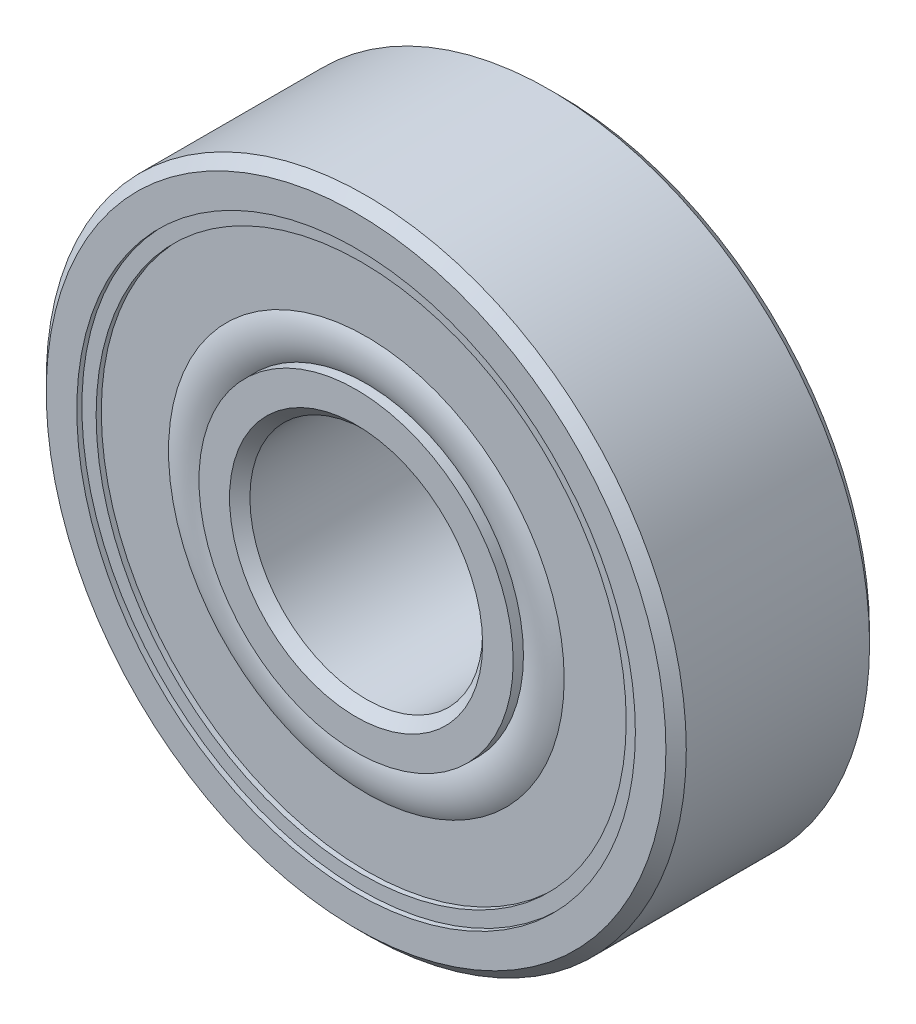
ISO-10303-21;
HEADER;
FILE_DESCRIPTION(('STEP AP214'),'2;1');
FILE_NAME('part.step','',(''),(''),'','','');
FILE_SCHEMA(('AUTOMOTIVE_DESIGN { 1 0 10303 214 1 1 1 1 }'));
ENDSEC;
DATA;
#1=APPLICATION_CONTEXT('core data for automotive mechanical design processes');
#2=APPLICATION_PROTOCOL_DEFINITION('international standard','automotive_design',2000,#1);
#3=PRODUCT_CONTEXT('',#1,'mechanical');
#4=PRODUCT('Part','Part','',(#3));
#5=PRODUCT_RELATED_PRODUCT_CATEGORY('part','',(#4));
#6=PRODUCT_DEFINITION_FORMATION('','',#4);
#7=PRODUCT_DEFINITION_CONTEXT('part definition',#1,'design');
#8=PRODUCT_DEFINITION('design','',#6,#7);
#9=PRODUCT_DEFINITION_SHAPE('','',#8);
#10=(LENGTH_UNIT() NAMED_UNIT(*) SI_UNIT(.MILLI.,.METRE.));
#11=(NAMED_UNIT(*) PLANE_ANGLE_UNIT() SI_UNIT($,.RADIAN.));
#12=(NAMED_UNIT(*) SI_UNIT($,.STERADIAN.) SOLID_ANGLE_UNIT());
#13=UNCERTAINTY_MEASURE_WITH_UNIT(LENGTH_MEASURE(1.E-05),#10,'distance_accuracy_value','');
#14=(GEOMETRIC_REPRESENTATION_CONTEXT(3) GLOBAL_UNCERTAINTY_ASSIGNED_CONTEXT((#13)) GLOBAL_UNIT_ASSIGNED_CONTEXT((#10,
#11,#12)) REPRESENTATION_CONTEXT('',''));
#15=CARTESIAN_POINT('',(0.,0.,0.));
#16=DIRECTION('',(0.,0.,1.));
#17=DIRECTION('',(1.,0.,0.));
#18=AXIS2_PLACEMENT_3D('',#15,#16,#17);
#19=CARTESIAN_POINT('',(0.,0.,-1.85890868663651));
#20=DIRECTION('',(0.,0.,1.));
#21=DIRECTION('',(1.,0.,0.));
#22=AXIS2_PLACEMENT_3D('',#19,#20,#21);
#23=TOROIDAL_SURFACE('',#22,6.10000000000001,1.46609131336349);
#24=CARTESIAN_POINT('',(0.,0.,-3.14709490730489));
#25=DIRECTION('',(0.,0.,1.));
#26=DIRECTION('',(1.,0.,0.));
#27=AXIS2_PLACEMENT_3D('',#24,#25,#26);
#28=CIRCLE('',#27,6.80000000000001);
#29=CARTESIAN_POINT('',(6.80000000000001,0.,-3.14709490730489));
#30=VERTEX_POINT('',#29);
#31=EDGE_CURVE('E11',#30,#30,#28,.T.);
#32=ORIENTED_EDGE('',*,*,#31,.F.);
#33=EDGE_LOOP('',(#32));
#34=FACE_BOUND('',#33,.T.);
#35=CARTESIAN_POINT('',(0.,0.,-3.14709490730489));
#36=DIRECTION('',(0.,0.,1.));
#37=DIRECTION('',(1.,0.,0.));
#38=AXIS2_PLACEMENT_3D('',#35,#36,#37);
#39=CIRCLE('',#38,5.40000000000001);
#40=CARTESIAN_POINT('',(5.40000000000001,0.,-3.14709490730489));
#41=VERTEX_POINT('',#40);
#42=EDGE_CURVE('E71',#41,#41,#39,.T.);
#43=ORIENTED_EDGE('',*,*,#42,.T.);
#44=EDGE_LOOP('',(#43));
#45=FACE_BOUND('',#44,.T.);
#46=ADVANCED_FACE('F46',(#34,#45),#23,.T.);
#47=CARTESIAN_POINT('',(0.,9.10999999999999,-3.14709490730489));
#48=DIRECTION('',(0.,0.,1.));
#49=DIRECTION('',(1.,0.,0.));
#50=AXIS2_PLACEMENT_3D('',#47,#48,#49);
#51=PLANE('',#50);
#52=CARTESIAN_POINT('',(0.,0.,-3.14709490730489));
#53=DIRECTION('',(0.,0.,1.));
#54=DIRECTION('',(1.,0.,0.));
#55=AXIS2_PLACEMENT_3D('',#52,#53,#54);
#56=CIRCLE('',#55,9.10999999999999);
#57=CARTESIAN_POINT('',(9.10999999999999,0.,-3.14709490730489));
#58=VERTEX_POINT('',#57);
#59=EDGE_CURVE('E52',#58,#58,#56,.T.);
#60=ORIENTED_EDGE('',*,*,#59,.F.);
#61=EDGE_LOOP('',(#60));
#62=FACE_BOUND('',#61,.T.);
#63=ORIENTED_EDGE('',*,*,#31,.T.);
#64=EDGE_LOOP('',(#63));
#65=FACE_BOUND('',#64,.T.);
#66=ADVANCED_FACE('F102',(#62,#65),#51,.F.);
#67=CARTESIAN_POINT('',(0.,0.,3.5));
#68=DIRECTION('',(0.,0.,1.));
#69=DIRECTION('',(1.,0.,0.));
#70=AXIS2_PLACEMENT_3D('',#67,#68,#69);
#71=CYLINDRICAL_SURFACE('',#70,9.10999999999999);
#72=CARTESIAN_POINT('',(0.,0.,-3.325));
#73=DIRECTION('',(0.,0.,1.));
#74=DIRECTION('',(1.,0.,0.));
#75=AXIS2_PLACEMENT_3D('',#72,#73,#74);
#76=CIRCLE('',#75,9.10999999999999);
#77=CARTESIAN_POINT('',(9.10999999999999,0.,-3.325));
#78=VERTEX_POINT('',#77);
#79=EDGE_CURVE('E56',#78,#78,#76,.T.);
#80=ORIENTED_EDGE('',*,*,#79,.F.);
#81=EDGE_LOOP('',(#80));
#82=FACE_BOUND('',#81,.T.);
#83=ORIENTED_EDGE('',*,*,#59,.T.);
#84=EDGE_LOOP('',(#83));
#85=FACE_BOUND('',#84,.T.);
#86=ADVANCED_FACE('F97',(#82,#85),#71,.F.);
#87=CARTESIAN_POINT('',(0.,9.59999999999999,-3.325));
#88=DIRECTION('',(0.,0.,1.));
#89=DIRECTION('',(1.,0.,0.));
#90=AXIS2_PLACEMENT_3D('',#87,#88,#89);
#91=PLANE('',#90);
#92=CARTESIAN_POINT('',(0.,0.,-3.325));
#93=DIRECTION('',(0.,0.,1.));
#94=DIRECTION('',(1.,0.,0.));
#95=AXIS2_PLACEMENT_3D('',#92,#93,#94);
#96=CIRCLE('',#95,9.59999999999999);
#97=CARTESIAN_POINT('',(9.59999999999999,0.,-3.325));
#98=VERTEX_POINT('',#97);
#99=EDGE_CURVE('E60',#98,#98,#96,.T.);
#100=ORIENTED_EDGE('',*,*,#99,.F.);
#101=EDGE_LOOP('',(#100));
#102=FACE_BOUND('',#101,.T.);
#103=ORIENTED_EDGE('',*,*,#79,.T.);
#104=EDGE_LOOP('',(#103));
#105=FACE_BOUND('',#104,.T.);
#106=ADVANCED_FACE('F91',(#102,#105),#91,.F.);
#107=CARTESIAN_POINT('',(0.,0.,3.5));
#108=DIRECTION('',(0.,0.,1.));
#109=DIRECTION('',(1.,0.,0.));
#110=AXIS2_PLACEMENT_3D('',#107,#108,#109);
#111=CYLINDRICAL_SURFACE('',#110,9.59999999999999);
#112=CARTESIAN_POINT('',(0.,0.,-2.61337962921956));
#113=DIRECTION('',(0.,0.,1.));
#114=DIRECTION('',(1.,0.,0.));
#115=AXIS2_PLACEMENT_3D('',#112,#113,#114);
#116=CIRCLE('',#115,9.59999999999999);
#117=CARTESIAN_POINT('',(9.59999999999999,0.,-2.61337962921956));
#118=VERTEX_POINT('',#117);
#119=EDGE_CURVE('E65',#118,#118,#116,.T.);
#120=ORIENTED_EDGE('',*,*,#119,.F.);
#121=EDGE_LOOP('',(#120));
#122=FACE_BOUND('',#121,.T.);
#123=ORIENTED_EDGE('',*,*,#99,.T.);
#124=EDGE_LOOP('',(#123));
#125=FACE_BOUND('',#124,.T.);
#126=ADVANCED_FACE('F85',(#122,#125),#111,.T.);
#127=CARTESIAN_POINT('',(0.,9.59999999999999,-2.61337962921956));
#128=DIRECTION('',(0.,0.,-1.));
#129=DIRECTION('',(-1.,0.,0.));
#130=AXIS2_PLACEMENT_3D('',#127,#128,#129);
#131=PLANE('',#130);
#132=CARTESIAN_POINT('',(0.,0.,-2.61337962921956));
#133=DIRECTION('',(0.,0.,1.));
#134=DIRECTION('',(1.,0.,0.));
#135=AXIS2_PLACEMENT_3D('',#132,#133,#134);
#136=CIRCLE('',#135,5.40000000000001);
#137=CARTESIAN_POINT('',(5.40000000000001,0.,-2.61337962921956));
#138=VERTEX_POINT('',#137);
#139=EDGE_CURVE('E68',#138,#138,#136,.T.);
#140=ORIENTED_EDGE('',*,*,#139,.F.);
#141=EDGE_LOOP('',(#140));
#142=FACE_BOUND('',#141,.T.);
#143=ORIENTED_EDGE('',*,*,#119,.T.);
#144=EDGE_LOOP('',(#143));
#145=FACE_BOUND('',#144,.T.);
#146=ADVANCED_FACE('F79',(#142,#145),#131,.F.);
#147=CARTESIAN_POINT('',(0.,0.,3.5));
#148=DIRECTION('',(0.,0.,1.));
#149=DIRECTION('',(1.,0.,0.));
#150=AXIS2_PLACEMENT_3D('',#147,#148,#149);
#151=CYLINDRICAL_SURFACE('',#150,5.40000000000001);
#152=ORIENTED_EDGE('',*,*,#42,.F.);
#153=EDGE_LOOP('',(#152));
#154=FACE_BOUND('',#153,.T.);
#155=ORIENTED_EDGE('',*,*,#139,.T.);
#156=EDGE_LOOP('',(#155));
#157=FACE_BOUND('',#156,.T.);
#158=ADVANCED_FACE('F76',(#154,#157),#151,.F.);
#159=CLOSED_SHELL('',(#46,#66,#86,#106,#126,#146,#158));
#160=MANIFOLD_SOLID_BREP('B2',#159);
#161=CARTESIAN_POINT('',(0.,9.59999999999999,3.325));
#162=DIRECTION('',(0.,0.,-1.));
#163=DIRECTION('',(-1.,0.,0.));
#164=AXIS2_PLACEMENT_3D('',#161,#162,#163);
#165=PLANE('',#164);
#166=CARTESIAN_POINT('',(0.,0.,3.325));
#167=DIRECTION('',(0.,0.,1.));
#168=DIRECTION('',(1.,0.,0.));
#169=AXIS2_PLACEMENT_3D('',#166,#167,#168);
#170=CIRCLE('',#169,9.10999999999999);
#171=CARTESIAN_POINT('',(9.10999999999999,0.,3.325));
#172=VERTEX_POINT('',#171);
#173=EDGE_CURVE('E170',#172,#172,#170,.T.);
#174=ORIENTED_EDGE('',*,*,#173,.F.);
#175=EDGE_LOOP('',(#174));
#176=FACE_BOUND('',#175,.T.);
#177=CARTESIAN_POINT('',(0.,0.,3.325));
#178=DIRECTION('',(0.,0.,1.));
#179=DIRECTION('',(1.,0.,0.));
#180=AXIS2_PLACEMENT_3D('',#177,#178,#179);
#181=CIRCLE('',#180,9.59999999999999);
#182=CARTESIAN_POINT('',(9.59999999999999,0.,3.325));
#183=VERTEX_POINT('',#182);
#184=EDGE_CURVE('E45',#183,#183,#181,.T.);
#185=ORIENTED_EDGE('',*,*,#184,.T.);
#186=EDGE_LOOP('',(#185));
#187=FACE_BOUND('',#186,.T.);
#188=ADVANCED_FACE('F145',(#176,#187),#165,.F.);
#189=CARTESIAN_POINT('',(0.,0.,3.5));
#190=DIRECTION('',(0.,0.,1.));
#191=DIRECTION('',(1.,0.,0.));
#192=AXIS2_PLACEMENT_3D('',#189,#190,#191);
#193=CYLINDRICAL_SURFACE('',#192,9.59999999999999);
#194=ORIENTED_EDGE('',*,*,#184,.F.);
#195=EDGE_LOOP('',(#194));
#196=FACE_BOUND('',#195,.T.);
#197=CARTESIAN_POINT('',(0.,0.,2.61337962921956));
#198=DIRECTION('',(0.,0.,1.));
#199=DIRECTION('',(1.,0.,0.));
#200=AXIS2_PLACEMENT_3D('',#197,#198,#199);
#201=CIRCLE('',#200,9.59999999999999);
#202=CARTESIAN_POINT('',(9.59999999999999,0.,2.61337962921956));
#203=VERTEX_POINT('',#202);
#204=EDGE_CURVE('E151',#203,#203,#201,.T.);
#205=ORIENTED_EDGE('',*,*,#204,.T.);
#206=EDGE_LOOP('',(#205));
#207=FACE_BOUND('',#206,.T.);
#208=ADVANCED_FACE('F177',(#196,#207),#193,.T.);
#209=CARTESIAN_POINT('',(0.,9.59999999999999,2.61337962921956));
#210=DIRECTION('',(0.,0.,1.));
#211=DIRECTION('',(1.,0.,0.));
#212=AXIS2_PLACEMENT_3D('',#209,#210,#211);
#213=PLANE('',#212);
#214=ORIENTED_EDGE('',*,*,#204,.F.);
#215=EDGE_LOOP('',(#214));
#216=FACE_BOUND('',#215,.T.);
#217=CARTESIAN_POINT('',(0.,0.,2.61337962921956));
#218=DIRECTION('',(0.,0.,1.));
#219=DIRECTION('',(1.,0.,0.));
#220=AXIS2_PLACEMENT_3D('',#217,#218,#219);
#221=CIRCLE('',#220,5.40000000000001);
#222=CARTESIAN_POINT('',(5.40000000000001,0.,2.61337962921956));
#223=VERTEX_POINT('',#222);
#224=EDGE_CURVE('E155',#223,#223,#221,.T.);
#225=ORIENTED_EDGE('',*,*,#224,.T.);
#226=EDGE_LOOP('',(#225));
#227=FACE_BOUND('',#226,.T.);
#228=ADVANCED_FACE('F181',(#216,#227),#213,.F.);
#229=CARTESIAN_POINT('',(0.,0.,3.5));
#230=DIRECTION('',(0.,0.,1.));
#231=DIRECTION('',(1.,0.,0.));
#232=AXIS2_PLACEMENT_3D('',#229,#230,#231);
#233=CYLINDRICAL_SURFACE('',#232,5.40000000000001);
#234=ORIENTED_EDGE('',*,*,#224,.F.);
#235=EDGE_LOOP('',(#234));
#236=FACE_BOUND('',#235,.T.);
#237=CARTESIAN_POINT('',(0.,0.,3.14709490730489));
#238=DIRECTION('',(0.,0.,1.));
#239=DIRECTION('',(1.,0.,0.));
#240=AXIS2_PLACEMENT_3D('',#237,#238,#239);
#241=CIRCLE('',#240,5.40000000000001);
#242=CARTESIAN_POINT('',(5.40000000000001,0.,3.14709490730489));
#243=VERTEX_POINT('',#242);
#244=EDGE_CURVE('E159',#243,#243,#241,.T.);
#245=ORIENTED_EDGE('',*,*,#244,.T.);
#246=EDGE_LOOP('',(#245));
#247=FACE_BOUND('',#246,.T.);
#248=ADVANCED_FACE('F186',(#236,#247),#233,.F.);
#249=CARTESIAN_POINT('',(0.,0.,1.85890868663651));
#250=DIRECTION('',(0.,0.,1.));
#251=DIRECTION('',(1.,0.,0.));
#252=AXIS2_PLACEMENT_3D('',#249,#250,#251);
#253=TOROIDAL_SURFACE('',#252,6.10000000000001,1.46609131336349);
#254=ORIENTED_EDGE('',*,*,#244,.F.);
#255=EDGE_LOOP('',(#254));
#256=FACE_BOUND('',#255,.T.);
#257=CARTESIAN_POINT('',(0.,0.,3.14709490730489));
#258=DIRECTION('',(0.,0.,1.));
#259=DIRECTION('',(1.,0.,0.));
#260=AXIS2_PLACEMENT_3D('',#257,#258,#259);
#261=CIRCLE('',#260,6.80000000000001);
#262=CARTESIAN_POINT('',(6.80000000000001,0.,3.14709490730489));
#263=VERTEX_POINT('',#262);
#264=EDGE_CURVE('E164',#263,#263,#261,.T.);
#265=ORIENTED_EDGE('',*,*,#264,.T.);
#266=EDGE_LOOP('',(#265));
#267=FACE_BOUND('',#266,.T.);
#268=ADVANCED_FACE('F192',(#256,#267),#253,.T.);
#269=CARTESIAN_POINT('',(0.,9.10999999999999,3.14709490730489));
#270=DIRECTION('',(0.,0.,-1.));
#271=DIRECTION('',(-1.,0.,0.));
#272=AXIS2_PLACEMENT_3D('',#269,#270,#271);
#273=PLANE('',#272);
#274=ORIENTED_EDGE('',*,*,#264,.F.);
#275=EDGE_LOOP('',(#274));
#276=FACE_BOUND('',#275,.T.);
#277=CARTESIAN_POINT('',(0.,0.,3.14709490730489));
#278=DIRECTION('',(0.,0.,1.));
#279=DIRECTION('',(1.,0.,0.));
#280=AXIS2_PLACEMENT_3D('',#277,#278,#279);
#281=CIRCLE('',#280,9.10999999999999);
#282=CARTESIAN_POINT('',(9.10999999999999,0.,3.14709490730489));
#283=VERTEX_POINT('',#282);
#284=EDGE_CURVE('E167',#283,#283,#281,.T.);
#285=ORIENTED_EDGE('',*,*,#284,.T.);
#286=EDGE_LOOP('',(#285));
#287=FACE_BOUND('',#286,.T.);
#288=ADVANCED_FACE('F196',(#276,#287),#273,.F.);
#289=CARTESIAN_POINT('',(0.,0.,3.5));
#290=DIRECTION('',(0.,0.,1.));
#291=DIRECTION('',(1.,0.,0.));
#292=AXIS2_PLACEMENT_3D('',#289,#290,#291);
#293=CYLINDRICAL_SURFACE('',#292,9.10999999999999);
#294=ORIENTED_EDGE('',*,*,#284,.F.);
#295=EDGE_LOOP('',(#294));
#296=FACE_BOUND('',#295,.T.);
#297=ORIENTED_EDGE('',*,*,#173,.T.);
#298=EDGE_LOOP('',(#297));
#299=FACE_BOUND('',#298,.T.);
#300=ADVANCED_FACE('F174',(#296,#299),#293,.F.);
#301=CLOSED_SHELL('',(#188,#208,#228,#248,#268,#288,#300));
#302=MANIFOLD_SOLID_BREP('B6',#301);
#303=CARTESIAN_POINT('',(-5.86373611851017,4.67617351394057,0.));
#304=DIRECTION('',(0.,0.,1.));
#305=DIRECTION('',(-0.781831482468022,0.623489801858743,0.));
#306=AXIS2_PLACEMENT_3D('',#303,#304,#305);
#307=SPHERICAL_SURFACE('',#306,2.61337962921956);
#308=CARTESIAN_POINT('',(-5.86373611851017,4.67617351394057,2.61337962921956));
#309=VERTEX_POINT('',#308);
#310=VERTEX_LOOP('',#309);
#311=FACE_BOUND('',#310,.T.);
#312=ADVANCED_FACE('F244',(#311),#307,.T.);
#313=CLOSED_SHELL('',(#312));
#314=MANIFOLD_SOLID_BREP('B40',#313);
#315=CARTESIAN_POINT('',(-7.31195934136369,-1.66890700467229,0.));
#316=DIRECTION('',(0.,0.,1.));
#317=DIRECTION('',(-0.974927912181826,-0.222520933956305,0.));
#318=AXIS2_PLACEMENT_3D('',#315,#316,#317);
#319=SPHERICAL_SURFACE('',#318,2.61337962921956);
#320=CARTESIAN_POINT('',(-7.31195934136369,-1.66890700467229,2.61337962921956));
#321=VERTEX_POINT('',#320);
#322=VERTEX_LOOP('',#321);
#323=FACE_BOUND('',#322,.T.);
#324=ADVANCED_FACE('F263',(#323),#319,.T.);
#325=CLOSED_SHELL('',(#324));
#326=MANIFOLD_SOLID_BREP('B141',#325);
#327=CARTESIAN_POINT('',(-3.25412804338174,-6.75726650926812,0.));
#328=DIRECTION('',(0.,0.,1.));
#329=DIRECTION('',(-0.433883739117565,-0.900968867902416,0.));
#330=AXIS2_PLACEMENT_3D('',#327,#328,#329);
#331=SPHERICAL_SURFACE('',#330,2.61337962921956);
#332=CARTESIAN_POINT('',(-3.25412804338174,-6.75726650926812,2.61337962921956));
#333=VERTEX_POINT('',#332);
#334=VERTEX_LOOP('',#333);
#335=FACE_BOUND('',#334,.T.);
#336=ADVANCED_FACE('F282',(#335),#331,.T.);
#337=CLOSED_SHELL('',(#336));
#338=MANIFOLD_SOLID_BREP('B240',#337);
#339=CARTESIAN_POINT('',(3.25412804338164,-6.75726650926816,0.));
#340=DIRECTION('',(0.,0.,1.));
#341=DIRECTION('',(0.433883739117553,-0.900968867902422,0.));
#342=AXIS2_PLACEMENT_3D('',#339,#340,#341);
#343=SPHERICAL_SURFACE('',#342,2.61337962921956);
#344=CARTESIAN_POINT('',(3.25412804338164,-6.75726650926816,2.61337962921956));
#345=VERTEX_POINT('',#344);
#346=VERTEX_LOOP('',#345);
#347=FACE_BOUND('',#346,.T.);
#348=ADVANCED_FACE('F301',(#347),#343,.T.);
#349=CLOSED_SHELL('',(#348));
#350=MANIFOLD_SOLID_BREP('B259',#349);
#351=CARTESIAN_POINT('',(7.31195934136367,-1.66890700467239,0.));
#352=DIRECTION('',(0.,0.,1.));
#353=DIRECTION('',(0.974927912181823,-0.222520933956318,0.));
#354=AXIS2_PLACEMENT_3D('',#351,#352,#353);
#355=SPHERICAL_SURFACE('',#354,2.61337962921956);
#356=CARTESIAN_POINT('',(7.31195934136367,-1.66890700467239,2.61337962921956));
#357=VERTEX_POINT('',#356);
#358=VERTEX_LOOP('',#357);
#359=FACE_BOUND('',#358,.T.);
#360=ADVANCED_FACE('F320',(#359),#355,.T.);
#361=CLOSED_SHELL('',(#360));
#362=MANIFOLD_SOLID_BREP('B278',#361);
#363=CARTESIAN_POINT('',(5.86373611851023,4.67617351394049,0.));
#364=DIRECTION('',(0.,0.,1.));
#365=DIRECTION('',(0.781831482468031,0.623489801858732,0.));
#366=AXIS2_PLACEMENT_3D('',#363,#364,#365);
#367=SPHERICAL_SURFACE('',#366,2.61337962921956);
#368=CARTESIAN_POINT('',(5.86373611851023,4.67617351394049,2.61337962921956));
#369=VERTEX_POINT('',#368);
#370=VERTEX_LOOP('',#369);
#371=FACE_BOUND('',#370,.T.);
#372=ADVANCED_FACE('F339',(#371),#367,.T.);
#373=CLOSED_SHELL('',(#372));
#374=MANIFOLD_SOLID_BREP('B297',#373);
#375=CARTESIAN_POINT('',(0.,7.5,0.));
#376=DIRECTION('',(0.,0.,1.));
#377=DIRECTION('',(0.,1.,0.));
#378=AXIS2_PLACEMENT_3D('',#375,#376,#377);
#379=SPHERICAL_SURFACE('',#378,2.61337962921956);
#380=CARTESIAN_POINT('',(0.,7.5,2.61337962921956));
#381=VERTEX_POINT('',#380);
#382=VERTEX_LOOP('',#381);
#383=FACE_BOUND('',#382,.T.);
#384=ADVANCED_FACE('F360',(#383),#379,.T.);
#385=CLOSED_SHELL('',(#384));
#386=MANIFOLD_SOLID_BREP('B316',#385);
#387=CARTESIAN_POINT('',(0.,0.,3.5));
#388=DIRECTION('',(0.,0.,1.));
#389=DIRECTION('',(1.,0.,0.));
#390=AXIS2_PLACEMENT_3D('',#387,#388,#389);
#391=CONICAL_SURFACE('',#390,4.35,0.785398163397449);
#392=CARTESIAN_POINT('',(0.,0.,3.15));
#393=DIRECTION('',(0.,0.,1.));
#394=DIRECTION('',(1.,0.,0.));
#395=AXIS2_PLACEMENT_3D('',#392,#393,#394);
#396=CIRCLE('',#395,4.);
#397=CARTESIAN_POINT('',(4.,0.,3.15));
#398=VERTEX_POINT('',#397);
#399=EDGE_CURVE('E359',#398,#398,#396,.T.);
#400=ORIENTED_EDGE('',*,*,#399,.F.);
#401=EDGE_LOOP('',(#400));
#402=FACE_BOUND('',#401,.T.);
#403=CARTESIAN_POINT('',(0.,0.,3.5));
#404=DIRECTION('',(0.,0.,1.));
#405=DIRECTION('',(1.,0.,0.));
#406=AXIS2_PLACEMENT_3D('',#403,#404,#405);
#407=CIRCLE('',#406,4.35);
#408=CARTESIAN_POINT('',(4.35,0.,3.5));
#409=VERTEX_POINT('',#408);
#410=EDGE_CURVE('E406',#409,#409,#407,.T.);
#411=ORIENTED_EDGE('',*,*,#410,.T.);
#412=EDGE_LOOP('',(#411));
#413=FACE_BOUND('',#412,.T.);
#414=ADVANCED_FACE('F378',(#402,#413),#391,.F.);
#415=CARTESIAN_POINT('',(0.,0.,3.5));
#416=DIRECTION('',(0.,0.,1.));
#417=DIRECTION('',(1.,0.,0.));
#418=AXIS2_PLACEMENT_3D('',#415,#416,#417);
#419=CYLINDRICAL_SURFACE('',#418,4.);
#420=CARTESIAN_POINT('',(0.,0.,-3.15));
#421=DIRECTION('',(0.,0.,1.));
#422=DIRECTION('',(1.,0.,0.));
#423=AXIS2_PLACEMENT_3D('',#420,#421,#422);
#424=CIRCLE('',#423,4.);
#425=CARTESIAN_POINT('',(4.,0.,-3.15));
#426=VERTEX_POINT('',#425);
#427=EDGE_CURVE('E384',#426,#426,#424,.T.);
#428=ORIENTED_EDGE('',*,*,#427,.F.);
#429=EDGE_LOOP('',(#428));
#430=FACE_BOUND('',#429,.T.);
#431=ORIENTED_EDGE('',*,*,#399,.T.);
#432=EDGE_LOOP('',(#431));
#433=FACE_BOUND('',#432,.T.);
#434=ADVANCED_FACE('F443',(#430,#433),#419,.F.);
#435=CARTESIAN_POINT('',(0.,0.,-3.15));
#436=DIRECTION('',(0.,0.,-1.));
#437=DIRECTION('',(-1.,0.,0.));
#438=AXIS2_PLACEMENT_3D('',#435,#436,#437);
#439=CONICAL_SURFACE('',#438,4.,0.785398163397447);
#440=CARTESIAN_POINT('',(0.,0.,-3.5));
#441=DIRECTION('',(0.,0.,1.));
#442=DIRECTION('',(1.,0.,0.));
#443=AXIS2_PLACEMENT_3D('',#440,#441,#442);
#444=CIRCLE('',#443,4.35);
#445=CARTESIAN_POINT('',(4.35,0.,-3.5));
#446=VERTEX_POINT('',#445);
#447=EDGE_CURVE('E388',#446,#446,#444,.T.);
#448=ORIENTED_EDGE('',*,*,#447,.F.);
#449=EDGE_LOOP('',(#448));
#450=FACE_BOUND('',#449,.T.);
#451=ORIENTED_EDGE('',*,*,#427,.T.);
#452=EDGE_LOOP('',(#451));
#453=FACE_BOUND('',#452,.T.);
#454=ADVANCED_FACE('F438',(#450,#453),#439,.F.);
#455=CARTESIAN_POINT('',(0.,4.35,-3.5));
#456=DIRECTION('',(0.,0.,1.));
#457=DIRECTION('',(1.,0.,0.));
#458=AXIS2_PLACEMENT_3D('',#455,#456,#457);
#459=PLANE('',#458);
#460=CARTESIAN_POINT('',(0.,0.,-3.5));
#461=DIRECTION('',(0.,0.,1.));
#462=DIRECTION('',(1.,0.,0.));
#463=AXIS2_PLACEMENT_3D('',#460,#461,#462);
#464=CIRCLE('',#463,5.40000000000001);
#465=CARTESIAN_POINT('',(5.40000000000001,0.,-3.5));
#466=VERTEX_POINT('',#465);
#467=EDGE_CURVE('E392',#466,#466,#464,.T.);
#468=ORIENTED_EDGE('',*,*,#467,.F.);
#469=EDGE_LOOP('',(#468));
#470=FACE_BOUND('',#469,.T.);
#471=ORIENTED_EDGE('',*,*,#447,.T.);
#472=EDGE_LOOP('',(#471));
#473=FACE_BOUND('',#472,.T.);
#474=ADVANCED_FACE('F432',(#470,#473),#459,.F.);
#475=CARTESIAN_POINT('',(0.,0.,3.5));
#476=DIRECTION('',(0.,0.,1.));
#477=DIRECTION('',(1.,0.,0.));
#478=AXIS2_PLACEMENT_3D('',#475,#476,#477);
#479=CYLINDRICAL_SURFACE('',#478,5.4);
#480=CARTESIAN_POINT('',(0.,0.,-1.55555555555556));
#481=DIRECTION('',(0.,0.,1.));
#482=DIRECTION('',(1.,0.,0.));
#483=AXIS2_PLACEMENT_3D('',#480,#481,#482);
#484=CIRCLE('',#483,5.4);
#485=CARTESIAN_POINT('',(5.4,0.,-1.55555555555556));
#486=VERTEX_POINT('',#485);
#487=EDGE_CURVE('E397',#486,#486,#484,.T.);
#488=ORIENTED_EDGE('',*,*,#487,.F.);
#489=EDGE_LOOP('',(#488));
#490=FACE_BOUND('',#489,.T.);
#491=ORIENTED_EDGE('',*,*,#467,.T.);
#492=EDGE_LOOP('',(#491));
#493=FACE_BOUND('',#492,.T.);
#494=ADVANCED_FACE('F426',(#490,#493),#479,.T.);
#495=CARTESIAN_POINT('',(0.,0.,0.));
#496=DIRECTION('',(0.,0.,1.));
#497=DIRECTION('',(1.,0.,0.));
#498=AXIS2_PLACEMENT_3D('',#495,#496,#497);
#499=TOROIDAL_SURFACE('',#498,7.5,2.61337962921956);
#500=CARTESIAN_POINT('',(0.,0.,1.55555555555556));
#501=DIRECTION('',(0.,0.,1.));
#502=DIRECTION('',(1.,0.,0.));
#503=AXIS2_PLACEMENT_3D('',#500,#501,#502);
#504=CIRCLE('',#503,5.4);
#505=CARTESIAN_POINT('',(5.4,0.,1.55555555555556));
#506=VERTEX_POINT('',#505);
#507=EDGE_CURVE('E400',#506,#506,#504,.T.);
#508=ORIENTED_EDGE('',*,*,#507,.F.);
#509=EDGE_LOOP('',(#508));
#510=FACE_BOUND('',#509,.T.);
#511=ORIENTED_EDGE('',*,*,#487,.T.);
#512=EDGE_LOOP('',(#511));
#513=FACE_BOUND('',#512,.T.);
#514=ADVANCED_FACE('F420',(#510,#513),#499,.F.);
#515=CARTESIAN_POINT('',(0.,0.,3.5));
#516=DIRECTION('',(0.,0.,1.));
#517=DIRECTION('',(1.,0.,0.));
#518=AXIS2_PLACEMENT_3D('',#515,#516,#517);
#519=CYLINDRICAL_SURFACE('',#518,5.4);
#520=CARTESIAN_POINT('',(0.,0.,3.5));
#521=DIRECTION('',(0.,0.,1.));
#522=DIRECTION('',(1.,0.,0.));
#523=AXIS2_PLACEMENT_3D('',#520,#521,#522);
#524=CIRCLE('',#523,5.40000000000001);
#525=CARTESIAN_POINT('',(5.40000000000001,0.,3.5));
#526=VERTEX_POINT('',#525);
#527=EDGE_CURVE('E403',#526,#526,#524,.T.);
#528=ORIENTED_EDGE('',*,*,#527,.F.);
#529=EDGE_LOOP('',(#528));
#530=FACE_BOUND('',#529,.T.);
#531=ORIENTED_EDGE('',*,*,#507,.T.);
#532=EDGE_LOOP('',(#531));
#533=FACE_BOUND('',#532,.T.);
#534=ADVANCED_FACE('F414',(#530,#533),#519,.T.);
#535=CARTESIAN_POINT('',(0.,4.35,3.5));
#536=DIRECTION('',(0.,0.,-1.));
#537=DIRECTION('',(-1.,0.,0.));
#538=AXIS2_PLACEMENT_3D('',#535,#536,#537);
#539=PLANE('',#538);
#540=ORIENTED_EDGE('',*,*,#410,.F.);
#541=EDGE_LOOP('',(#540));
#542=FACE_BOUND('',#541,.T.);
#543=ORIENTED_EDGE('',*,*,#527,.T.);
#544=EDGE_LOOP('',(#543));
#545=FACE_BOUND('',#544,.T.);
#546=ADVANCED_FACE('F411',(#542,#545),#539,.F.);
#547=CLOSED_SHELL('',(#414,#434,#454,#474,#494,#514,#534,#546));
#548=MANIFOLD_SOLID_BREP('B335',#547);
#549=CARTESIAN_POINT('',(0.,0.,3.15));
#550=DIRECTION('',(0.,0.,-1.));
#551=DIRECTION('',(-1.,0.,0.));
#552=AXIS2_PLACEMENT_3D('',#549,#550,#551);
#553=CONICAL_SURFACE('',#552,11.,0.785398163397447);
#554=CARTESIAN_POINT('',(0.,0.,3.5));
#555=DIRECTION('',(0.,0.,1.));
#556=DIRECTION('',(1.,0.,0.));
#557=AXIS2_PLACEMENT_3D('',#554,#555,#556);
#558=CIRCLE('',#557,10.65);
#559=CARTESIAN_POINT('',(10.65,0.,3.5));
#560=VERTEX_POINT('',#559);
#561=EDGE_CURVE('E377',#560,#560,#558,.T.);
#562=ORIENTED_EDGE('',*,*,#561,.F.);
#563=EDGE_LOOP('',(#562));
#564=FACE_BOUND('',#563,.T.);
#565=CARTESIAN_POINT('',(0.,0.,3.15));
#566=DIRECTION('',(0.,0.,1.));
#567=DIRECTION('',(1.,0.,0.));
#568=AXIS2_PLACEMENT_3D('',#565,#566,#567);
#569=CIRCLE('',#568,11.);
#570=CARTESIAN_POINT('',(11.,0.,3.15));
#571=VERTEX_POINT('',#570);
#572=EDGE_CURVE('E512',#571,#571,#569,.T.);
#573=ORIENTED_EDGE('',*,*,#572,.T.);
#574=EDGE_LOOP('',(#573));
#575=FACE_BOUND('',#574,.T.);
#576=ADVANCED_FACE('F484',(#564,#575),#553,.T.);
#577=CARTESIAN_POINT('',(0.,10.65,3.5));
#578=DIRECTION('',(0.,0.,-1.));
#579=DIRECTION('',(-1.,0.,0.));
#580=AXIS2_PLACEMENT_3D('',#577,#578,#579);
#581=PLANE('',#580);
#582=CARTESIAN_POINT('',(0.,0.,3.5));
#583=DIRECTION('',(0.,0.,1.));
#584=DIRECTION('',(1.,0.,0.));
#585=AXIS2_PLACEMENT_3D('',#582,#583,#584);
#586=CIRCLE('',#585,9.59999999999999);
#587=CARTESIAN_POINT('',(9.59999999999999,0.,3.5));
#588=VERTEX_POINT('',#587);
#589=EDGE_CURVE('E490',#588,#588,#586,.T.);
#590=ORIENTED_EDGE('',*,*,#589,.F.);
#591=EDGE_LOOP('',(#590));
#592=FACE_BOUND('',#591,.T.);
#593=ORIENTED_EDGE('',*,*,#561,.T.);
#594=EDGE_LOOP('',(#593));
#595=FACE_BOUND('',#594,.T.);
#596=ADVANCED_FACE('F549',(#592,#595),#581,.F.);
#597=CARTESIAN_POINT('',(0.,0.,3.5));
#598=DIRECTION('',(0.,0.,1.));
#599=DIRECTION('',(1.,0.,0.));
#600=AXIS2_PLACEMENT_3D('',#597,#598,#599);
#601=CYLINDRICAL_SURFACE('',#600,9.6);
#602=CARTESIAN_POINT('',(0.,0.,1.55555555555556));
#603=DIRECTION('',(0.,0.,1.));
#604=DIRECTION('',(1.,0.,0.));
#605=AXIS2_PLACEMENT_3D('',#602,#603,#604);
#606=CIRCLE('',#605,9.6);
#607=CARTESIAN_POINT('',(9.6,0.,1.55555555555556));
#608=VERTEX_POINT('',#607);
#609=EDGE_CURVE('E494',#608,#608,#606,.T.);
#610=ORIENTED_EDGE('',*,*,#609,.F.);
#611=EDGE_LOOP('',(#610));
#612=FACE_BOUND('',#611,.T.);
#613=ORIENTED_EDGE('',*,*,#589,.T.);
#614=EDGE_LOOP('',(#613));
#615=FACE_BOUND('',#614,.T.);
#616=ADVANCED_FACE('F544',(#612,#615),#601,.F.);
#617=CARTESIAN_POINT('',(0.,0.,0.));
#618=DIRECTION('',(0.,0.,1.));
#619=DIRECTION('',(1.,0.,0.));
#620=AXIS2_PLACEMENT_3D('',#617,#618,#619);
#621=TOROIDAL_SURFACE('',#620,7.5,2.61337962921956);
#622=CARTESIAN_POINT('',(0.,0.,-1.55555555555556));
#623=DIRECTION('',(0.,0.,1.));
#624=DIRECTION('',(1.,0.,0.));
#625=AXIS2_PLACEMENT_3D('',#622,#623,#624);
#626=CIRCLE('',#625,9.6);
#627=CARTESIAN_POINT('',(9.6,0.,-1.55555555555556));
#628=VERTEX_POINT('',#627);
#629=EDGE_CURVE('E498',#628,#628,#626,.T.);
#630=ORIENTED_EDGE('',*,*,#629,.F.);
#631=EDGE_LOOP('',(#630));
#632=FACE_BOUND('',#631,.T.);
#633=ORIENTED_EDGE('',*,*,#609,.T.);
#634=EDGE_LOOP('',(#633));
#635=FACE_BOUND('',#634,.T.);
#636=ADVANCED_FACE('F538',(#632,#635),#621,.F.);
#637=CARTESIAN_POINT('',(0.,0.,3.5));
#638=DIRECTION('',(0.,0.,1.));
#639=DIRECTION('',(1.,0.,0.));
#640=AXIS2_PLACEMENT_3D('',#637,#638,#639);
#641=CYLINDRICAL_SURFACE('',#640,9.6);
#642=CARTESIAN_POINT('',(0.,0.,-3.5));
#643=DIRECTION('',(0.,0.,1.));
#644=DIRECTION('',(1.,0.,0.));
#645=AXIS2_PLACEMENT_3D('',#642,#643,#644);
#646=CIRCLE('',#645,9.59999999999999);
#647=CARTESIAN_POINT('',(9.59999999999999,0.,-3.5));
#648=VERTEX_POINT('',#647);
#649=EDGE_CURVE('E503',#648,#648,#646,.T.);
#650=ORIENTED_EDGE('',*,*,#649,.F.);
#651=EDGE_LOOP('',(#650));
#652=FACE_BOUND('',#651,.T.);
#653=ORIENTED_EDGE('',*,*,#629,.T.);
#654=EDGE_LOOP('',(#653));
#655=FACE_BOUND('',#654,.T.);
#656=ADVANCED_FACE('F532',(#652,#655),#641,.F.);
#657=CARTESIAN_POINT('',(0.,10.65,-3.5));
#658=DIRECTION('',(0.,0.,1.));
#659=DIRECTION('',(1.,0.,0.));
#660=AXIS2_PLACEMENT_3D('',#657,#658,#659);
#661=PLANE('',#660);
#662=CARTESIAN_POINT('',(0.,0.,-3.5));
#663=DIRECTION('',(0.,0.,1.));
#664=DIRECTION('',(1.,0.,0.));
#665=AXIS2_PLACEMENT_3D('',#662,#663,#664);
#666=CIRCLE('',#665,10.65);
#667=CARTESIAN_POINT('',(10.65,0.,-3.5));
#668=VERTEX_POINT('',#667);
#669=EDGE_CURVE('E506',#668,#668,#666,.T.);
#670=ORIENTED_EDGE('',*,*,#669,.F.);
#671=EDGE_LOOP('',(#670));
#672=FACE_BOUND('',#671,.T.);
#673=ORIENTED_EDGE('',*,*,#649,.T.);
#674=EDGE_LOOP('',(#673));
#675=FACE_BOUND('',#674,.T.);
#676=ADVANCED_FACE('F526',(#672,#675),#661,.F.);
#677=CARTESIAN_POINT('',(0.,0.,-3.5));
#678=DIRECTION('',(0.,0.,1.));
#679=DIRECTION('',(1.,0.,0.));
#680=AXIS2_PLACEMENT_3D('',#677,#678,#679);
#681=CONICAL_SURFACE('',#680,10.65,0.785398163397442);
#682=CARTESIAN_POINT('',(0.,0.,-3.15));
#683=DIRECTION('',(0.,0.,1.));
#684=DIRECTION('',(1.,0.,0.));
#685=AXIS2_PLACEMENT_3D('',#682,#683,#684);
#686=CIRCLE('',#685,11.);
#687=CARTESIAN_POINT('',(11.,0.,-3.15));
#688=VERTEX_POINT('',#687);
#689=EDGE_CURVE('E509',#688,#688,#686,.T.);
#690=ORIENTED_EDGE('',*,*,#689,.F.);
#691=EDGE_LOOP('',(#690));
#692=FACE_BOUND('',#691,.T.);
#693=ORIENTED_EDGE('',*,*,#669,.T.);
#694=EDGE_LOOP('',(#693));
#695=FACE_BOUND('',#694,.T.);
#696=ADVANCED_FACE('F520',(#692,#695),#681,.T.);
#697=CARTESIAN_POINT('',(0.,0.,3.5));
#698=DIRECTION('',(0.,0.,1.));
#699=DIRECTION('',(1.,0.,0.));
#700=AXIS2_PLACEMENT_3D('',#697,#698,#699);
#701=CYLINDRICAL_SURFACE('',#700,11.);
#702=ORIENTED_EDGE('',*,*,#572,.F.);
#703=EDGE_LOOP('',(#702));
#704=FACE_BOUND('',#703,.T.);
#705=ORIENTED_EDGE('',*,*,#689,.T.);
#706=EDGE_LOOP('',(#705));
#707=FACE_BOUND('',#706,.T.);
#708=ADVANCED_FACE('F517',(#704,#707),#701,.T.);
#709=CLOSED_SHELL('',(#576,#596,#616,#636,#656,#676,#696,#708));
#710=MANIFOLD_SOLID_BREP('B354',#709);
#711=ADVANCED_BREP_SHAPE_REPRESENTATION('',(#18,#160,#302,#314,#326,#338,#350,#362,#374,#386,
#548,#710),#14);
#712=SHAPE_DEFINITION_REPRESENTATION(#9,#711);
ENDSEC;
END-ISO-10303-21;
